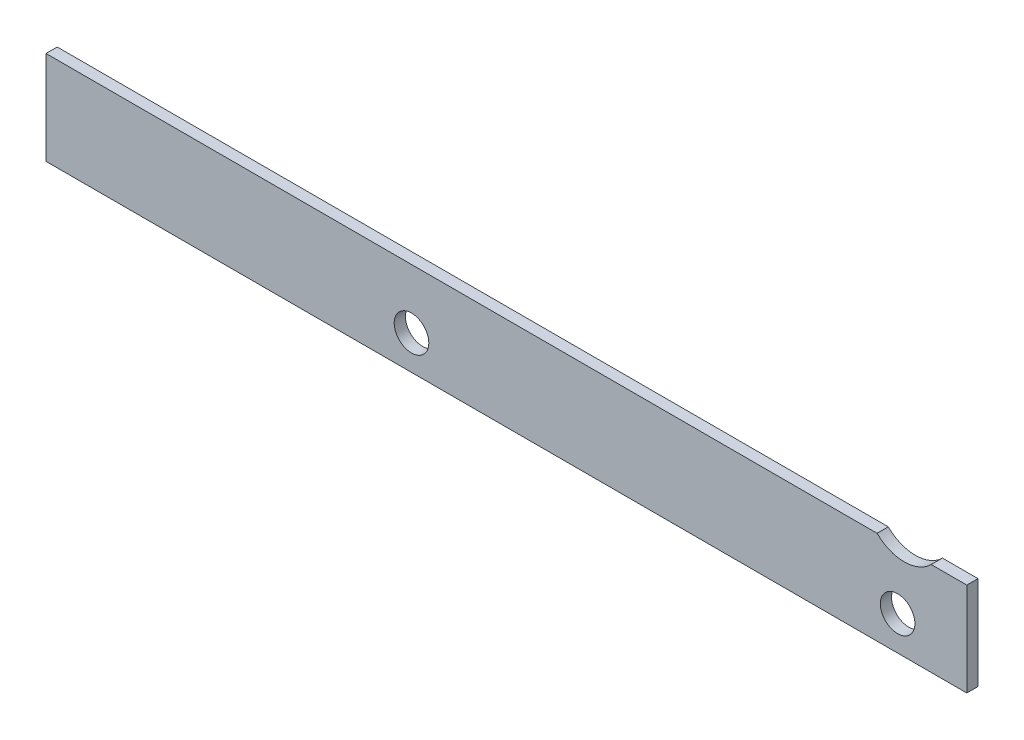
ISO-10303-21;
HEADER;
FILE_DESCRIPTION(('STEP AP214'),'2;1');
FILE_NAME('part.step','',(''),(''),'','','');
FILE_SCHEMA(('AUTOMOTIVE_DESIGN { 1 0 10303 214 1 1 1 1 }'));
ENDSEC;
DATA;
#1=APPLICATION_CONTEXT('core data for automotive mechanical design processes');
#2=APPLICATION_PROTOCOL_DEFINITION('international standard','automotive_design',2000,#1);
#3=PRODUCT_CONTEXT('',#1,'mechanical');
#4=PRODUCT('Part','Part','',(#3));
#5=PRODUCT_RELATED_PRODUCT_CATEGORY('part','',(#4));
#6=PRODUCT_DEFINITION_FORMATION('','',#4);
#7=PRODUCT_DEFINITION_CONTEXT('part definition',#1,'design');
#8=PRODUCT_DEFINITION('design','',#6,#7);
#9=PRODUCT_DEFINITION_SHAPE('','',#8);
#10=(LENGTH_UNIT() NAMED_UNIT(*) SI_UNIT(.MILLI.,.METRE.));
#11=(NAMED_UNIT(*) PLANE_ANGLE_UNIT() SI_UNIT($,.RADIAN.));
#12=(NAMED_UNIT(*) SI_UNIT($,.STERADIAN.) SOLID_ANGLE_UNIT());
#13=UNCERTAINTY_MEASURE_WITH_UNIT(LENGTH_MEASURE(1.E-05),#10,'distance_accuracy_value','');
#14=(GEOMETRIC_REPRESENTATION_CONTEXT(3) GLOBAL_UNCERTAINTY_ASSIGNED_CONTEXT((#13)) GLOBAL_UNIT_ASSIGNED_CONTEXT((#10,
#11,#12)) REPRESENTATION_CONTEXT('',''));
#15=CARTESIAN_POINT('',(0.,0.,0.));
#16=DIRECTION('',(0.,0.,1.));
#17=DIRECTION('',(1.,0.,0.));
#18=AXIS2_PLACEMENT_3D('',#15,#16,#17);
#19=CARTESIAN_POINT('',(0.,100.,12.));
#20=DIRECTION('',(1.,0.,0.));
#21=DIRECTION('',(0.,1.,0.));
#22=AXIS2_PLACEMENT_3D('',#19,#20,#21);
#23=PLANE('',#22);
#24=DIRECTION('',(0.,-1.,0.));
#25=VECTOR('',#24,1.);
#26=CARTESIAN_POINT('',(0.,100.,0.));
#27=LINE('',#26,#25);
#28=CARTESIAN_POINT('',(0.,100.,0.));
#29=VERTEX_POINT('',#28);
#30=CARTESIAN_POINT('',(0.,0.,0.));
#31=VERTEX_POINT('',#30);
#32=EDGE_CURVE('E127',#29,#31,#27,.T.);
#33=ORIENTED_EDGE('',*,*,#32,.T.);
#34=DIRECTION('',(0.,0.,-1.));
#35=VECTOR('',#34,1.);
#36=CARTESIAN_POINT('',(0.,0.,12.));
#37=LINE('',#36,#35);
#38=CARTESIAN_POINT('',(0.,0.,12.));
#39=VERTEX_POINT('',#38);
#40=EDGE_CURVE('E11',#39,#31,#37,.T.);
#41=ORIENTED_EDGE('',*,*,#40,.F.);
#42=DIRECTION('',(0.,-1.,0.));
#43=VECTOR('',#42,1.);
#44=CARTESIAN_POINT('',(0.,100.,12.));
#45=LINE('',#44,#43);
#46=CARTESIAN_POINT('',(0.,100.,12.));
#47=VERTEX_POINT('',#46);
#48=EDGE_CURVE('E144',#47,#39,#45,.T.);
#49=ORIENTED_EDGE('',*,*,#48,.F.);
#50=DIRECTION('',(0.,0.,-1.));
#51=VECTOR('',#50,1.);
#52=CARTESIAN_POINT('',(0.,100.,12.));
#53=LINE('',#52,#51);
#54=EDGE_CURVE('E123',#47,#29,#53,.T.);
#55=ORIENTED_EDGE('',*,*,#54,.T.);
#56=EDGE_LOOP('',(#33,#41,#49,#55));
#57=FACE_BOUND('',#56,.T.);
#58=ADVANCED_FACE('F38',(#57),#23,.F.);
#59=CARTESIAN_POINT('',(0.,0.,12.));
#60=DIRECTION('',(0.,1.,0.));
#61=DIRECTION('',(0.,0.,1.));
#62=AXIS2_PLACEMENT_3D('',#59,#60,#61);
#63=PLANE('',#62);
#64=DIRECTION('',(1.,0.,0.));
#65=VECTOR('',#64,1.);
#66=CARTESIAN_POINT('',(0.,0.,0.));
#67=LINE('',#66,#65);
#68=CARTESIAN_POINT('',(985.,0.,0.));
#69=VERTEX_POINT('',#68);
#70=EDGE_CURVE('E131',#31,#69,#67,.T.);
#71=ORIENTED_EDGE('',*,*,#70,.T.);
#72=DIRECTION('',(0.,0.,-1.));
#73=VECTOR('',#72,1.);
#74=CARTESIAN_POINT('',(985.,0.,12.));
#75=LINE('',#74,#73);
#76=CARTESIAN_POINT('',(985.,0.,12.));
#77=VERTEX_POINT('',#76);
#78=EDGE_CURVE('E47',#77,#69,#75,.T.);
#79=ORIENTED_EDGE('',*,*,#78,.F.);
#80=DIRECTION('',(1.,0.,0.));
#81=VECTOR('',#80,1.);
#82=CARTESIAN_POINT('',(0.,0.,12.));
#83=LINE('',#82,#81);
#84=EDGE_CURVE('E92',#39,#77,#83,.T.);
#85=ORIENTED_EDGE('',*,*,#84,.F.);
#86=ORIENTED_EDGE('',*,*,#40,.T.);
#87=EDGE_LOOP('',(#71,#79,#85,#86));
#88=FACE_BOUND('',#87,.T.);
#89=ADVANCED_FACE('F174',(#88),#63,.F.);
#90=CARTESIAN_POINT('',(985.,0.,12.));
#91=DIRECTION('',(-1.,0.,0.));
#92=DIRECTION('',(0.,0.,1.));
#93=AXIS2_PLACEMENT_3D('',#90,#91,#92);
#94=PLANE('',#93);
#95=DIRECTION('',(0.,1.,0.));
#96=VECTOR('',#95,1.);
#97=CARTESIAN_POINT('',(985.,0.,0.));
#98=LINE('',#97,#96);
#99=CARTESIAN_POINT('',(985.,100.,0.));
#100=VERTEX_POINT('',#99);
#101=EDGE_CURVE('E135',#69,#100,#98,.T.);
#102=ORIENTED_EDGE('',*,*,#101,.T.);
#103=DIRECTION('',(0.,0.,-1.));
#104=VECTOR('',#103,1.);
#105=CARTESIAN_POINT('',(985.,100.,12.));
#106=LINE('',#105,#104);
#107=CARTESIAN_POINT('',(985.,100.,12.));
#108=VERTEX_POINT('',#107);
#109=EDGE_CURVE('E116',#108,#100,#106,.T.);
#110=ORIENTED_EDGE('',*,*,#109,.F.);
#111=DIRECTION('',(0.,1.,0.));
#112=VECTOR('',#111,1.);
#113=CARTESIAN_POINT('',(985.,0.,12.));
#114=LINE('',#113,#112);
#115=EDGE_CURVE('E105',#77,#108,#114,.T.);
#116=ORIENTED_EDGE('',*,*,#115,.F.);
#117=ORIENTED_EDGE('',*,*,#78,.T.);
#118=EDGE_LOOP('',(#102,#110,#116,#117));
#119=FACE_BOUND('',#118,.T.);
#120=ADVANCED_FACE('F154',(#119),#94,.F.);
#121=CARTESIAN_POINT('',(985.,100.,12.));
#122=DIRECTION('',(0.,-1.,0.));
#123=DIRECTION('',(1.,0.,0.));
#124=AXIS2_PLACEMENT_3D('',#121,#122,#123);
#125=PLANE('',#124);
#126=DIRECTION('',(-1.,0.,0.));
#127=VECTOR('',#126,1.);
#128=CARTESIAN_POINT('',(985.,100.,0.));
#129=LINE('',#128,#127);
#130=CARTESIAN_POINT('',(946.952353926806,100.,0.));
#131=VERTEX_POINT('',#130);
#132=EDGE_CURVE('E114',#100,#131,#129,.T.);
#133=ORIENTED_EDGE('',*,*,#132,.T.);
#134=DIRECTION('',(0.,0.,-1.));
#135=VECTOR('',#134,1.);
#136=CARTESIAN_POINT('',(946.952353926806,100.,12.));
#137=LINE('',#136,#135);
#138=CARTESIAN_POINT('',(946.952353926806,100.,12.));
#139=VERTEX_POINT('',#138);
#140=EDGE_CURVE('E111',#139,#131,#137,.T.);
#141=ORIENTED_EDGE('',*,*,#140,.F.);
#142=DIRECTION('',(-1.,0.,0.));
#143=VECTOR('',#142,1.);
#144=CARTESIAN_POINT('',(985.,100.,12.));
#145=LINE('',#144,#143);
#146=EDGE_CURVE('E99',#108,#139,#145,.T.);
#147=ORIENTED_EDGE('',*,*,#146,.F.);
#148=ORIENTED_EDGE('',*,*,#109,.T.);
#149=EDGE_LOOP('',(#133,#141,#147,#148));
#150=FACE_BOUND('',#149,.T.);
#151=ADVANCED_FACE('F112',(#150),#125,.F.);
#152=CARTESIAN_POINT('',(918.,129.,12.));
#153=DIRECTION('',(0.,0.,-1.));
#154=DIRECTION('',(-1.,0.,0.));
#155=AXIS2_PLACEMENT_3D('',#152,#153,#154);
#156=CYLINDRICAL_SURFACE('',#155,40.9785162969945);
#157=CARTESIAN_POINT('',(918.,129.,0.));
#158=DIRECTION('',(0.,0.,-1.));
#159=DIRECTION('',(1.,0.,0.));
#160=AXIS2_PLACEMENT_3D('',#157,#158,#159);
#161=CIRCLE('',#160,40.9785162969945);
#162=CARTESIAN_POINT('',(889.047646073194,100.,0.));
#163=VERTEX_POINT('',#162);
#164=EDGE_CURVE('E78',#131,#163,#161,.T.);
#165=ORIENTED_EDGE('',*,*,#164,.T.);
#166=DIRECTION('',(0.,0.,-1.));
#167=VECTOR('',#166,1.);
#168=CARTESIAN_POINT('',(889.047646073194,100.,12.));
#169=LINE('',#168,#167);
#170=CARTESIAN_POINT('',(889.047646073194,100.,12.));
#171=VERTEX_POINT('',#170);
#172=EDGE_CURVE('E117',#171,#163,#169,.T.);
#173=ORIENTED_EDGE('',*,*,#172,.F.);
#174=CARTESIAN_POINT('',(918.,129.,12.));
#175=DIRECTION('',(0.,0.,-1.));
#176=DIRECTION('',(1.,0.,0.));
#177=AXIS2_PLACEMENT_3D('',#174,#175,#176);
#178=CIRCLE('',#177,40.9785162969945);
#179=EDGE_CURVE('E103',#139,#171,#178,.T.);
#180=ORIENTED_EDGE('',*,*,#179,.F.);
#181=ORIENTED_EDGE('',*,*,#140,.T.);
#182=EDGE_LOOP('',(#165,#173,#180,#181));
#183=FACE_BOUND('',#182,.T.);
#184=ADVANCED_FACE('F119',(#183),#156,.F.);
#185=CARTESIAN_POINT('',(889.047646073194,100.,12.));
#186=DIRECTION('',(0.,-1.,0.));
#187=DIRECTION('',(1.,0.,0.));
#188=AXIS2_PLACEMENT_3D('',#185,#186,#187);
#189=PLANE('',#188);
#190=DIRECTION('',(-1.,0.,0.));
#191=VECTOR('',#190,1.);
#192=CARTESIAN_POINT('',(889.047646073194,100.,0.));
#193=LINE('',#192,#191);
#194=EDGE_CURVE('E84',#163,#29,#193,.T.);
#195=ORIENTED_EDGE('',*,*,#194,.T.);
#196=ORIENTED_EDGE('',*,*,#54,.F.);
#197=DIRECTION('',(-1.,0.,0.));
#198=VECTOR('',#197,1.);
#199=CARTESIAN_POINT('',(889.047646073194,100.,12.));
#200=LINE('',#199,#198);
#201=EDGE_CURVE('E55',#171,#47,#200,.T.);
#202=ORIENTED_EDGE('',*,*,#201,.F.);
#203=ORIENTED_EDGE('',*,*,#172,.T.);
#204=EDGE_LOOP('',(#195,#196,#202,#203));
#205=FACE_BOUND('',#204,.T.);
#206=ADVANCED_FACE('F161',(#205),#189,.F.);
#207=CARTESIAN_POINT('',(918.,129.,12.));
#208=DIRECTION('',(0.,0.,1.));
#209=DIRECTION('',(1.,0.,0.));
#210=AXIS2_PLACEMENT_3D('',#207,#208,#209);
#211=PLANE('',#210);
#212=CARTESIAN_POINT('',(391.,36.5,12.));
#213=DIRECTION('',(0.,0.,1.));
#214=DIRECTION('',(1.,0.,0.));
#215=AXIS2_PLACEMENT_3D('',#212,#213,#214);
#216=CIRCLE('',#215,18.5);
#217=CARTESIAN_POINT('',(409.5,36.5,12.));
#218=VERTEX_POINT('',#217);
#219=EDGE_CURVE('E235',#218,#218,#216,.T.);
#220=ORIENTED_EDGE('',*,*,#219,.F.);
#221=EDGE_LOOP('',(#220));
#222=FACE_BOUND('',#221,.T.);
#223=CARTESIAN_POINT('',(911.,36.5,12.));
#224=DIRECTION('',(0.,0.,1.));
#225=DIRECTION('',(1.,0.,0.));
#226=AXIS2_PLACEMENT_3D('',#223,#224,#225);
#227=CIRCLE('',#226,18.5);
#228=CARTESIAN_POINT('',(929.5,36.5,12.));
#229=VERTEX_POINT('',#228);
#230=EDGE_CURVE('E239',#229,#229,#227,.T.);
#231=ORIENTED_EDGE('',*,*,#230,.F.);
#232=EDGE_LOOP('',(#231));
#233=FACE_BOUND('',#232,.T.);
#234=ORIENTED_EDGE('',*,*,#48,.T.);
#235=ORIENTED_EDGE('',*,*,#84,.T.);
#236=ORIENTED_EDGE('',*,*,#115,.T.);
#237=ORIENTED_EDGE('',*,*,#146,.T.);
#238=ORIENTED_EDGE('',*,*,#179,.T.);
#239=ORIENTED_EDGE('',*,*,#201,.T.);
#240=EDGE_LOOP('',(#234,#235,#236,#237,#238,#239));
#241=FACE_BOUND('',#240,.T.);
#242=ADVANCED_FACE('F101',(#222,#233,#241),#211,.T.);
#243=CARTESIAN_POINT('',(918.,129.,0.));
#244=DIRECTION('',(0.,0.,1.));
#245=DIRECTION('',(1.,0.,0.));
#246=AXIS2_PLACEMENT_3D('',#243,#244,#245);
#247=PLANE('',#246);
#248=CARTESIAN_POINT('',(391.,36.5,0.));
#249=DIRECTION('',(0.,0.,1.));
#250=DIRECTION('',(1.,0.,0.));
#251=AXIS2_PLACEMENT_3D('',#248,#249,#250);
#252=CIRCLE('',#251,18.5);
#253=CARTESIAN_POINT('',(409.5,36.5,0.));
#254=VERTEX_POINT('',#253);
#255=EDGE_CURVE('E232',#254,#254,#252,.T.);
#256=ORIENTED_EDGE('',*,*,#255,.T.);
#257=EDGE_LOOP('',(#256));
#258=FACE_BOUND('',#257,.T.);
#259=CARTESIAN_POINT('',(911.,36.5,0.));
#260=DIRECTION('',(0.,0.,1.));
#261=DIRECTION('',(1.,0.,0.));
#262=AXIS2_PLACEMENT_3D('',#259,#260,#261);
#263=CIRCLE('',#262,18.5);
#264=CARTESIAN_POINT('',(929.5,36.5,0.));
#265=VERTEX_POINT('',#264);
#266=EDGE_CURVE('E132',#265,#265,#263,.T.);
#267=ORIENTED_EDGE('',*,*,#266,.T.);
#268=EDGE_LOOP('',(#267));
#269=FACE_BOUND('',#268,.T.);
#270=ORIENTED_EDGE('',*,*,#32,.F.);
#271=ORIENTED_EDGE('',*,*,#194,.F.);
#272=ORIENTED_EDGE('',*,*,#164,.F.);
#273=ORIENTED_EDGE('',*,*,#132,.F.);
#274=ORIENTED_EDGE('',*,*,#101,.F.);
#275=ORIENTED_EDGE('',*,*,#70,.F.);
#276=EDGE_LOOP('',(#270,#271,#272,#273,#274,#275));
#277=FACE_BOUND('',#276,.T.);
#278=ADVANCED_FACE('F157',(#258,#269,#277),#247,.F.);
#279=CARTESIAN_POINT('',(911.,36.5,0.));
#280=DIRECTION('',(0.,0.,1.));
#281=DIRECTION('',(1.,0.,0.));
#282=AXIS2_PLACEMENT_3D('',#279,#280,#281);
#283=CYLINDRICAL_SURFACE('',#282,18.5);
#284=ORIENTED_EDGE('',*,*,#266,.F.);
#285=EDGE_LOOP('',(#284));
#286=FACE_BOUND('',#285,.T.);
#287=ORIENTED_EDGE('',*,*,#230,.T.);
#288=EDGE_LOOP('',(#287));
#289=FACE_BOUND('',#288,.T.);
#290=ADVANCED_FACE('F202',(#286,#289),#283,.F.);
#291=CARTESIAN_POINT('',(391.,36.5,0.));
#292=DIRECTION('',(0.,0.,1.));
#293=DIRECTION('',(1.,0.,0.));
#294=AXIS2_PLACEMENT_3D('',#291,#292,#293);
#295=CYLINDRICAL_SURFACE('',#294,18.5);
#296=ORIENTED_EDGE('',*,*,#255,.F.);
#297=EDGE_LOOP('',(#296));
#298=FACE_BOUND('',#297,.T.);
#299=ORIENTED_EDGE('',*,*,#219,.T.);
#300=EDGE_LOOP('',(#299));
#301=FACE_BOUND('',#300,.T.);
#302=ADVANCED_FACE('F206',(#298,#301),#295,.F.);
#303=CLOSED_SHELL('',(#58,#89,#120,#151,#184,#206,#242,#278,#290,#302));
#304=MANIFOLD_SOLID_BREP('B2',#303);
#305=ADVANCED_BREP_SHAPE_REPRESENTATION('',(#18,#304),#14);
#306=SHAPE_DEFINITION_REPRESENTATION(#9,#305);
ENDSEC;
END-ISO-10303-21;
